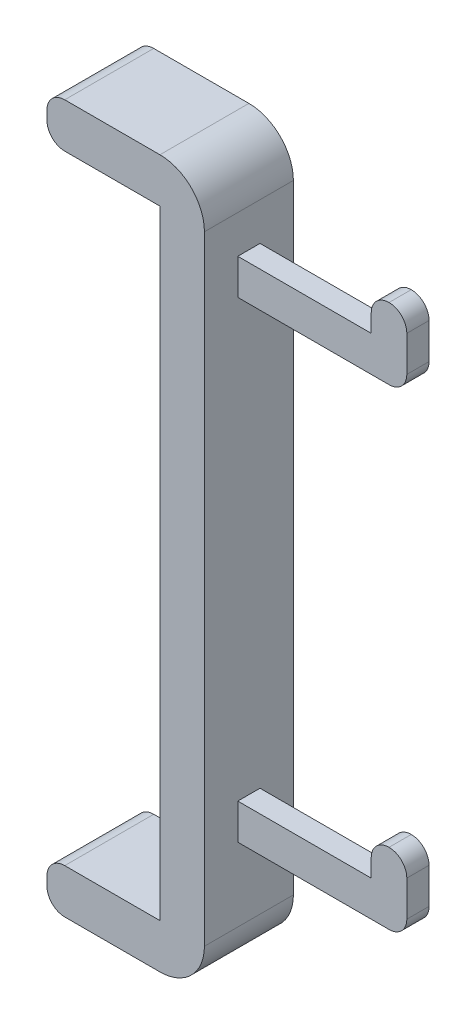
ISO-10303-21;
HEADER;
FILE_DESCRIPTION(('STEP AP214'),'2;1');
FILE_NAME('part.step','',(''),(''),'','','');
FILE_SCHEMA(('AUTOMOTIVE_DESIGN { 1 0 10303 214 1 1 1 1 }'));
ENDSEC;
DATA;
#1=APPLICATION_CONTEXT('core data for automotive mechanical design processes');
#2=APPLICATION_PROTOCOL_DEFINITION('international standard','automotive_design',2000,#1);
#3=PRODUCT_CONTEXT('',#1,'mechanical');
#4=PRODUCT('Part','Part','',(#3));
#5=PRODUCT_RELATED_PRODUCT_CATEGORY('part','',(#4));
#6=PRODUCT_DEFINITION_FORMATION('','',#4);
#7=PRODUCT_DEFINITION_CONTEXT('part definition',#1,'design');
#8=PRODUCT_DEFINITION('design','',#6,#7);
#9=PRODUCT_DEFINITION_SHAPE('','',#8);
#10=(LENGTH_UNIT() NAMED_UNIT(*) SI_UNIT(.MILLI.,.METRE.));
#11=(NAMED_UNIT(*) PLANE_ANGLE_UNIT() SI_UNIT($,.RADIAN.));
#12=(NAMED_UNIT(*) SI_UNIT($,.STERADIAN.) SOLID_ANGLE_UNIT());
#13=UNCERTAINTY_MEASURE_WITH_UNIT(LENGTH_MEASURE(1.E-05),#10,'distance_accuracy_value','');
#14=(GEOMETRIC_REPRESENTATION_CONTEXT(3) GLOBAL_UNCERTAINTY_ASSIGNED_CONTEXT((#13)) GLOBAL_UNIT_ASSIGNED_CONTEXT((#10,
#11,#12)) REPRESENTATION_CONTEXT('',''));
#15=CARTESIAN_POINT('',(0.,0.,0.));
#16=DIRECTION('',(0.,0.,1.));
#17=DIRECTION('',(1.,0.,0.));
#18=AXIS2_PLACEMENT_3D('',#15,#16,#17);
#19=CARTESIAN_POINT('',(-22.5103825249103,0.,-10.));
#20=DIRECTION('',(1.,0.,0.));
#21=DIRECTION('',(0.,0.,-1.));
#22=AXIS2_PLACEMENT_3D('',#19,#20,#21);
#23=PLANE('',#22);
#24=DIRECTION('',(0.,1.,0.));
#25=VECTOR('',#24,1.);
#26=CARTESIAN_POINT('',(-22.5103825249103,0.,-10.));
#27=LINE('',#26,#25);
#28=CARTESIAN_POINT('',(-22.5103825249103,-92.3717774812002,-10.));
#29=VERTEX_POINT('',#28);
#30=CARTESIAN_POINT('',(-22.5103825249103,46.7282225187998,-10.));
#31=VERTEX_POINT('',#30);
#32=EDGE_CURVE('E339',#29,#31,#27,.T.);
#33=ORIENTED_EDGE('',*,*,#32,.T.);
#34=DIRECTION('',(0.,0.,1.));
#35=VECTOR('',#34,1.);
#36=CARTESIAN_POINT('',(-22.5103825249103,46.7282225187998,10.));
#37=LINE('',#36,#35);
#38=CARTESIAN_POINT('',(-22.5103825249103,46.7282225187998,10.));
#39=VERTEX_POINT('',#38);
#40=EDGE_CURVE('E365',#31,#39,#37,.T.);
#41=ORIENTED_EDGE('',*,*,#40,.T.);
#42=DIRECTION('',(0.,1.,0.));
#43=VECTOR('',#42,1.);
#44=CARTESIAN_POINT('',(-22.5103825249103,0.,10.));
#45=LINE('',#44,#43);
#46=CARTESIAN_POINT('',(-22.5103825249103,-92.3717774812002,10.));
#47=VERTEX_POINT('',#46);
#48=EDGE_CURVE('E314',#47,#39,#45,.T.);
#49=ORIENTED_EDGE('',*,*,#48,.F.);
#50=DIRECTION('',(0.,0.,1.));
#51=VECTOR('',#50,1.);
#52=CARTESIAN_POINT('',(-22.5103825249103,-92.3717774812002,-10.));
#53=LINE('',#52,#51);
#54=EDGE_CURVE('E362',#47,#29,#53,.F.);
#55=ORIENTED_EDGE('',*,*,#54,.T.);
#56=EDGE_LOOP('',(#33,#41,#49,#55));
#57=FACE_BOUND('',#56,.T.);
#58=DIRECTION('',(0.,0.,1.));
#59=VECTOR('',#58,1.);
#60=CARTESIAN_POINT('',(-22.5103825249103,38.2115558521331,-2.5));
#61=LINE('',#60,#59);
#62=CARTESIAN_POINT('',(-22.5103825249103,38.2115558521331,-2.5));
#63=VERTEX_POINT('',#62);
#64=CARTESIAN_POINT('',(-22.5103825249103,38.2115558521331,2.5));
#65=VERTEX_POINT('',#64);
#66=EDGE_CURVE('E315',#63,#65,#61,.T.);
#67=ORIENTED_EDGE('',*,*,#66,.F.);
#68=DIRECTION('',(0.,1.,0.));
#69=VECTOR('',#68,1.);
#70=CARTESIAN_POINT('',(-22.5103825249103,0.,-2.5));
#71=LINE('',#70,#69);
#72=CARTESIAN_POINT('',(-22.5103825249103,30.2115558521331,-2.5));
#73=VERTEX_POINT('',#72);
#74=EDGE_CURVE('E302',#73,#63,#71,.T.);
#75=ORIENTED_EDGE('',*,*,#74,.F.);
#76=DIRECTION('',(0.,0.,1.));
#77=VECTOR('',#76,1.);
#78=CARTESIAN_POINT('',(-22.5103825249103,30.2115558521331,-2.5));
#79=LINE('',#78,#77);
#80=CARTESIAN_POINT('',(-22.5103825249103,30.2115558521331,2.5));
#81=VERTEX_POINT('',#80);
#82=EDGE_CURVE('E312',#73,#81,#79,.T.);
#83=ORIENTED_EDGE('',*,*,#82,.T.);
#84=DIRECTION('',(0.,1.,0.));
#85=VECTOR('',#84,1.);
#86=CARTESIAN_POINT('',(-22.5103825249103,0.,2.5));
#87=LINE('',#86,#85);
#88=EDGE_CURVE('E289',#81,#65,#87,.T.);
#89=ORIENTED_EDGE('',*,*,#88,.T.);
#90=EDGE_LOOP('',(#67,#75,#83,#89));
#91=FACE_BOUND('',#90,.T.);
#92=DIRECTION('',(0.,0.,1.));
#93=VECTOR('',#92,1.);
#94=CARTESIAN_POINT('',(-22.5103825249103,-67.8551108145335,-2.5));
#95=LINE('',#94,#93);
#96=CARTESIAN_POINT('',(-22.5103825249103,-67.8551108145335,-2.5));
#97=VERTEX_POINT('',#96);
#98=CARTESIAN_POINT('',(-22.5103825249103,-67.8551108145335,2.5));
#99=VERTEX_POINT('',#98);
#100=EDGE_CURVE('E255',#97,#99,#95,.T.);
#101=ORIENTED_EDGE('',*,*,#100,.F.);
#102=DIRECTION('',(0.,1.,0.));
#103=VECTOR('',#102,1.);
#104=CARTESIAN_POINT('',(-22.5103825249103,0.,-2.5));
#105=LINE('',#104,#103);
#106=CARTESIAN_POINT('',(-22.5103825249103,-75.8551108145336,-2.5));
#107=VERTEX_POINT('',#106);
#108=EDGE_CURVE('E273',#107,#97,#105,.T.);
#109=ORIENTED_EDGE('',*,*,#108,.F.);
#110=DIRECTION('',(0.,0.,1.));
#111=VECTOR('',#110,1.);
#112=CARTESIAN_POINT('',(-22.5103825249103,-75.8551108145336,-2.5));
#113=LINE('',#112,#111);
#114=CARTESIAN_POINT('',(-22.5103825249103,-75.8551108145336,2.5));
#115=VERTEX_POINT('',#114);
#116=EDGE_CURVE('E281',#107,#115,#113,.T.);
#117=ORIENTED_EDGE('',*,*,#116,.T.);
#118=DIRECTION('',(0.,1.,0.));
#119=VECTOR('',#118,1.);
#120=CARTESIAN_POINT('',(-22.5103825249103,0.,2.5));
#121=LINE('',#120,#119);
#122=EDGE_CURVE('E260',#115,#99,#121,.T.);
#123=ORIENTED_EDGE('',*,*,#122,.T.);
#124=EDGE_LOOP('',(#101,#109,#117,#123));
#125=FACE_BOUND('',#124,.T.);
#126=ADVANCED_FACE('F37',(#57,#91,#125),#23,.T.);
#127=CARTESIAN_POINT('',(0.,-102.3717774812,-10.));
#128=DIRECTION('',(0.,1.,0.));
#129=DIRECTION('',(-1.,0.,0.));
#130=AXIS2_PLACEMENT_3D('',#127,#128,#129);
#131=PLANE('',#130);
#132=DIRECTION('',(-1.,0.,0.));
#133=VECTOR('',#132,1.);
#134=CARTESIAN_POINT('',(0.,-102.3717774812,10.));
#135=LINE('',#134,#133);
#136=CARTESIAN_POINT('',(-32.5103825249103,-102.3717774812,10.));
#137=VERTEX_POINT('',#136);
#138=CARTESIAN_POINT('',(-53.9103825249103,-102.3717774812,10.));
#139=VERTEX_POINT('',#138);
#140=EDGE_CURVE('E336',#137,#139,#135,.T.);
#141=ORIENTED_EDGE('',*,*,#140,.T.);
#142=DIRECTION('',(0.,0.,1.));
#143=VECTOR('',#142,1.);
#144=CARTESIAN_POINT('',(-53.9103825249103,-102.3717774812,-10.));
#145=LINE('',#144,#143);
#146=CARTESIAN_POINT('',(-53.9103825249103,-102.3717774812,-10.));
#147=VERTEX_POINT('',#146);
#148=EDGE_CURVE('E395',#139,#147,#145,.F.);
#149=ORIENTED_EDGE('',*,*,#148,.T.);
#150=DIRECTION('',(-1.,0.,0.));
#151=VECTOR('',#150,1.);
#152=CARTESIAN_POINT('',(0.,-102.3717774812,-10.));
#153=LINE('',#152,#151);
#154=CARTESIAN_POINT('',(-32.5103825249103,-102.3717774812,-10.));
#155=VERTEX_POINT('',#154);
#156=EDGE_CURVE('E355',#155,#147,#153,.T.);
#157=ORIENTED_EDGE('',*,*,#156,.F.);
#158=DIRECTION('',(0.,0.,1.));
#159=VECTOR('',#158,1.);
#160=CARTESIAN_POINT('',(-32.5103825249103,-102.3717774812,10.));
#161=LINE('',#160,#159);
#162=EDGE_CURVE('E380',#155,#137,#161,.T.);
#163=ORIENTED_EDGE('',*,*,#162,.T.);
#164=EDGE_LOOP('',(#141,#149,#157,#163));
#165=FACE_BOUND('',#164,.T.);
#166=ADVANCED_FACE('F497',(#165),#131,.F.);
#167=CARTESIAN_POINT('',(-57.9103825249103,0.,-10.));
#168=DIRECTION('',(1.,0.,0.));
#169=DIRECTION('',(0.,0.,-1.));
#170=AXIS2_PLACEMENT_3D('',#167,#168,#169);
#171=PLANE('',#170);
#172=DIRECTION('',(0.,1.,0.));
#173=VECTOR('',#172,1.);
#174=CARTESIAN_POINT('',(-57.9103825249103,0.,-10.));
#175=LINE('',#174,#173);
#176=CARTESIAN_POINT('',(-57.9103825249103,-98.3717774812002,-10.));
#177=VERTEX_POINT('',#176);
#178=CARTESIAN_POINT('',(-57.9103825249103,-96.3717774812002,-10.));
#179=VERTEX_POINT('',#178);
#180=EDGE_CURVE('E352',#177,#179,#175,.T.);
#181=ORIENTED_EDGE('',*,*,#180,.F.);
#182=DIRECTION('',(0.,0.,1.));
#183=VECTOR('',#182,1.);
#184=CARTESIAN_POINT('',(-57.9103825249103,-98.3717774812002,-10.));
#185=LINE('',#184,#183);
#186=CARTESIAN_POINT('',(-57.9103825249103,-98.3717774812002,10.));
#187=VERTEX_POINT('',#186);
#188=EDGE_CURVE('E385',#177,#187,#185,.T.);
#189=ORIENTED_EDGE('',*,*,#188,.T.);
#190=DIRECTION('',(0.,1.,0.));
#191=VECTOR('',#190,1.);
#192=CARTESIAN_POINT('',(-57.9103825249103,0.,10.));
#193=LINE('',#192,#191);
#194=CARTESIAN_POINT('',(-57.9103825249103,-96.3717774812002,10.));
#195=VERTEX_POINT('',#194);
#196=EDGE_CURVE('E333',#187,#195,#193,.T.);
#197=ORIENTED_EDGE('',*,*,#196,.T.);
#198=DIRECTION('',(0.,0.,1.));
#199=VECTOR('',#198,1.);
#200=CARTESIAN_POINT('',(-57.9103825249103,-96.3717774812002,-10.));
#201=LINE('',#200,#199);
#202=EDGE_CURVE('E383',#195,#179,#201,.F.);
#203=ORIENTED_EDGE('',*,*,#202,.T.);
#204=EDGE_LOOP('',(#181,#189,#197,#203));
#205=FACE_BOUND('',#204,.T.);
#206=ADVANCED_FACE('F506',(#205),#171,.F.);
#207=CARTESIAN_POINT('',(0.,-92.3717774812003,-10.));
#208=DIRECTION('',(0.,-1.,0.));
#209=DIRECTION('',(1.,0.,0.));
#210=AXIS2_PLACEMENT_3D('',#207,#208,#209);
#211=PLANE('',#210);
#212=DIRECTION('',(1.,0.,0.));
#213=VECTOR('',#212,1.);
#214=CARTESIAN_POINT('',(0.,-92.3717774812003,-10.));
#215=LINE('',#214,#213);
#216=CARTESIAN_POINT('',(-53.9103825249103,-92.3717774812002,-10.));
#217=VERTEX_POINT('',#216);
#218=CARTESIAN_POINT('',(-32.5103825249103,-92.3717774812003,-10.));
#219=VERTEX_POINT('',#218);
#220=EDGE_CURVE('E350',#217,#219,#215,.T.);
#221=ORIENTED_EDGE('',*,*,#220,.F.);
#222=DIRECTION('',(0.,0.,1.));
#223=VECTOR('',#222,1.);
#224=CARTESIAN_POINT('',(-53.9103825249103,-92.3717774812002,-10.));
#225=LINE('',#224,#223);
#226=CARTESIAN_POINT('',(-53.9103825249103,-92.3717774812002,10.));
#227=VERTEX_POINT('',#226);
#228=EDGE_CURVE('E403',#217,#227,#225,.T.);
#229=ORIENTED_EDGE('',*,*,#228,.T.);
#230=DIRECTION('',(1.,0.,0.));
#231=VECTOR('',#230,1.);
#232=CARTESIAN_POINT('',(0.,-92.3717774812003,10.));
#233=LINE('',#232,#231);
#234=CARTESIAN_POINT('',(-32.5103825249103,-92.3717774812003,10.));
#235=VERTEX_POINT('',#234);
#236=EDGE_CURVE('E331',#227,#235,#233,.T.);
#237=ORIENTED_EDGE('',*,*,#236,.T.);
#238=DIRECTION('',(0.,0.,1.));
#239=VECTOR('',#238,1.);
#240=CARTESIAN_POINT('',(-32.5103825249103,-92.3717774812003,-10.));
#241=LINE('',#240,#239);
#242=EDGE_CURVE('E359',#219,#235,#241,.T.);
#243=ORIENTED_EDGE('',*,*,#242,.F.);
#244=EDGE_LOOP('',(#221,#229,#237,#243));
#245=FACE_BOUND('',#244,.T.);
#246=ADVANCED_FACE('F515',(#245),#211,.F.);
#247=CARTESIAN_POINT('',(-32.5103825249103,0.,-10.));
#248=DIRECTION('',(1.,0.,0.));
#249=DIRECTION('',(0.,1.,0.));
#250=AXIS2_PLACEMENT_3D('',#247,#248,#249);
#251=PLANE('',#250);
#252=ORIENTED_EDGE('',*,*,#242,.T.);
#253=DIRECTION('',(0.,1.,0.));
#254=VECTOR('',#253,1.);
#255=CARTESIAN_POINT('',(-32.5103825249103,0.,10.));
#256=LINE('',#255,#254);
#257=CARTESIAN_POINT('',(-32.5103825249103,46.7282225187998,10.));
#258=VERTEX_POINT('',#257);
#259=EDGE_CURVE('E328',#235,#258,#256,.T.);
#260=ORIENTED_EDGE('',*,*,#259,.T.);
#261=DIRECTION('',(0.,0.,1.));
#262=VECTOR('',#261,1.);
#263=CARTESIAN_POINT('',(-32.5103825249103,46.7282225187998,-10.));
#264=LINE('',#263,#262);
#265=CARTESIAN_POINT('',(-32.5103825249103,46.7282225187998,-10.));
#266=VERTEX_POINT('',#265);
#267=EDGE_CURVE('E358',#266,#258,#264,.T.);
#268=ORIENTED_EDGE('',*,*,#267,.F.);
#269=DIRECTION('',(0.,1.,0.));
#270=VECTOR('',#269,1.);
#271=CARTESIAN_POINT('',(-32.5103825249103,0.,-10.));
#272=LINE('',#271,#270);
#273=EDGE_CURVE('E348',#219,#266,#272,.T.);
#274=ORIENTED_EDGE('',*,*,#273,.F.);
#275=EDGE_LOOP('',(#252,#260,#268,#274));
#276=FACE_BOUND('',#275,.T.);
#277=ADVANCED_FACE('F521',(#276),#251,.F.);
#278=CARTESIAN_POINT('',(0.,46.7282225187998,-10.));
#279=DIRECTION('',(0.,1.,0.));
#280=DIRECTION('',(0.,0.,1.));
#281=AXIS2_PLACEMENT_3D('',#278,#279,#280);
#282=PLANE('',#281);
#283=DIRECTION('',(-1.,0.,0.));
#284=VECTOR('',#283,1.);
#285=CARTESIAN_POINT('',(0.,46.7282225187998,10.));
#286=LINE('',#285,#284);
#287=CARTESIAN_POINT('',(-53.9103825249103,46.7282225187998,10.));
#288=VERTEX_POINT('',#287);
#289=EDGE_CURVE('E326',#258,#288,#286,.T.);
#290=ORIENTED_EDGE('',*,*,#289,.T.);
#291=DIRECTION('',(0.,0.,1.));
#292=VECTOR('',#291,1.);
#293=CARTESIAN_POINT('',(-53.9103825249103,46.7282225187998,-10.));
#294=LINE('',#293,#292);
#295=CARTESIAN_POINT('',(-53.9103825249103,46.7282225187998,-10.));
#296=VERTEX_POINT('',#295);
#297=EDGE_CURVE('E45',#288,#296,#294,.F.);
#298=ORIENTED_EDGE('',*,*,#297,.T.);
#299=DIRECTION('',(-1.,0.,0.));
#300=VECTOR('',#299,1.);
#301=CARTESIAN_POINT('',(0.,46.7282225187998,-10.));
#302=LINE('',#301,#300);
#303=EDGE_CURVE('E346',#266,#296,#302,.T.);
#304=ORIENTED_EDGE('',*,*,#303,.F.);
#305=ORIENTED_EDGE('',*,*,#267,.T.);
#306=EDGE_LOOP('',(#290,#298,#304,#305));
#307=FACE_BOUND('',#306,.T.);
#308=ADVANCED_FACE('F624',(#307),#282,.F.);
#309=CARTESIAN_POINT('',(-57.9103825249103,0.,-10.));
#310=DIRECTION('',(1.,0.,0.));
#311=DIRECTION('',(0.,0.,-1.));
#312=AXIS2_PLACEMENT_3D('',#309,#310,#311);
#313=PLANE('',#312);
#314=DIRECTION('',(0.,1.,0.));
#315=VECTOR('',#314,1.);
#316=CARTESIAN_POINT('',(-57.9103825249103,0.,-10.));
#317=LINE('',#316,#315);
#318=CARTESIAN_POINT('',(-57.9103825249103,50.7282225187998,-10.));
#319=VERTEX_POINT('',#318);
#320=CARTESIAN_POINT('',(-57.9103825249103,52.7282225187998,-10.));
#321=VERTEX_POINT('',#320);
#322=EDGE_CURVE('E344',#319,#321,#317,.T.);
#323=ORIENTED_EDGE('',*,*,#322,.F.);
#324=DIRECTION('',(0.,0.,1.));
#325=VECTOR('',#324,1.);
#326=CARTESIAN_POINT('',(-57.9103825249103,50.7282225187998,-10.));
#327=LINE('',#326,#325);
#328=CARTESIAN_POINT('',(-57.9103825249103,50.7282225187998,10.));
#329=VERTEX_POINT('',#328);
#330=EDGE_CURVE('E454',#319,#329,#327,.T.);
#331=ORIENTED_EDGE('',*,*,#330,.T.);
#332=DIRECTION('',(0.,1.,0.));
#333=VECTOR('',#332,1.);
#334=CARTESIAN_POINT('',(-57.9103825249103,0.,10.));
#335=LINE('',#334,#333);
#336=CARTESIAN_POINT('',(-57.9103825249103,52.7282225187998,10.));
#337=VERTEX_POINT('',#336);
#338=EDGE_CURVE('E324',#329,#337,#335,.T.);
#339=ORIENTED_EDGE('',*,*,#338,.T.);
#340=DIRECTION('',(0.,0.,1.));
#341=VECTOR('',#340,1.);
#342=CARTESIAN_POINT('',(-57.9103825249103,52.7282225187998,-10.));
#343=LINE('',#342,#341);
#344=EDGE_CURVE('E451',#337,#321,#343,.F.);
#345=ORIENTED_EDGE('',*,*,#344,.T.);
#346=EDGE_LOOP('',(#323,#331,#339,#345));
#347=FACE_BOUND('',#346,.T.);
#348=ADVANCED_FACE('F465',(#347),#313,.F.);
#349=CARTESIAN_POINT('',(0.,56.7282225187998,-10.));
#350=DIRECTION('',(0.,-1.,0.));
#351=DIRECTION('',(1.,0.,0.));
#352=AXIS2_PLACEMENT_3D('',#349,#350,#351);
#353=PLANE('',#352);
#354=DIRECTION('',(1.,0.,0.));
#355=VECTOR('',#354,1.);
#356=CARTESIAN_POINT('',(0.,56.7282225187998,-10.));
#357=LINE('',#356,#355);
#358=CARTESIAN_POINT('',(-53.9103825249103,56.7282225187998,-10.));
#359=VERTEX_POINT('',#358);
#360=CARTESIAN_POINT('',(-32.5103825249103,56.7282225187998,-10.));
#361=VERTEX_POINT('',#360);
#362=EDGE_CURVE('E342',#359,#361,#357,.T.);
#363=ORIENTED_EDGE('',*,*,#362,.F.);
#364=DIRECTION('',(0.,0.,1.));
#365=VECTOR('',#364,1.);
#366=CARTESIAN_POINT('',(-53.9103825249103,56.7282225187998,-10.));
#367=LINE('',#366,#365);
#368=CARTESIAN_POINT('',(-53.9103825249103,56.7282225187998,10.));
#369=VERTEX_POINT('',#368);
#370=EDGE_CURVE('E448',#359,#369,#367,.T.);
#371=ORIENTED_EDGE('',*,*,#370,.T.);
#372=DIRECTION('',(1.,0.,0.));
#373=VECTOR('',#372,1.);
#374=CARTESIAN_POINT('',(0.,56.7282225187998,10.));
#375=LINE('',#374,#373);
#376=CARTESIAN_POINT('',(-32.5103825249103,56.7282225187998,10.));
#377=VERTEX_POINT('',#376);
#378=EDGE_CURVE('E322',#369,#377,#375,.T.);
#379=ORIENTED_EDGE('',*,*,#378,.T.);
#380=DIRECTION('',(0.,0.,1.));
#381=VECTOR('',#380,1.);
#382=CARTESIAN_POINT('',(-32.5103825249103,56.7282225187998,-10.));
#383=LINE('',#382,#381);
#384=EDGE_CURVE('E373',#377,#361,#383,.F.);
#385=ORIENTED_EDGE('',*,*,#384,.T.);
#386=EDGE_LOOP('',(#363,#371,#379,#385));
#387=FACE_BOUND('',#386,.T.);
#388=ADVANCED_FACE('F479',(#387),#353,.F.);
#389=CARTESIAN_POINT('',(0.,0.,-10.));
#390=DIRECTION('',(0.,0.,1.));
#391=DIRECTION('',(1.,0.,0.));
#392=AXIS2_PLACEMENT_3D('',#389,#390,#391);
#393=PLANE('',#392);
#394=ORIENTED_EDGE('',*,*,#303,.T.);
#395=CARTESIAN_POINT('',(-53.9103825249103,50.7282225187998,-10.));
#396=DIRECTION('',(0.,0.,1.));
#397=DIRECTION('',(1.,0.,0.));
#398=AXIS2_PLACEMENT_3D('',#395,#396,#397);
#399=CIRCLE('',#398,4.);
#400=EDGE_CURVE('E11',#296,#319,#399,.F.);
#401=ORIENTED_EDGE('',*,*,#400,.T.);
#402=ORIENTED_EDGE('',*,*,#322,.T.);
#403=CARTESIAN_POINT('',(-53.9103825249103,52.7282225187998,-10.));
#404=DIRECTION('',(0.,0.,1.));
#405=DIRECTION('',(1.,0.,0.));
#406=AXIS2_PLACEMENT_3D('',#403,#404,#405);
#407=CIRCLE('',#406,4.);
#408=EDGE_CURVE('E397',#321,#359,#407,.F.);
#409=ORIENTED_EDGE('',*,*,#408,.T.);
#410=ORIENTED_EDGE('',*,*,#362,.T.);
#411=CARTESIAN_POINT('',(-32.5103825249103,46.7282225187998,-10.));
#412=DIRECTION('',(0.,0.,1.));
#413=DIRECTION('',(1.,0.,0.));
#414=AXIS2_PLACEMENT_3D('',#411,#412,#413);
#415=CIRCLE('',#414,10.);
#416=EDGE_CURVE('E378',#361,#31,#415,.F.);
#417=ORIENTED_EDGE('',*,*,#416,.T.);
#418=ORIENTED_EDGE('',*,*,#32,.F.);
#419=CARTESIAN_POINT('',(-32.5103825249103,-92.3717774812002,-10.));
#420=DIRECTION('',(0.,0.,1.));
#421=DIRECTION('',(1.,0.,0.));
#422=AXIS2_PLACEMENT_3D('',#419,#420,#421);
#423=CIRCLE('',#422,10.);
#424=EDGE_CURVE('E376',#29,#155,#423,.F.);
#425=ORIENTED_EDGE('',*,*,#424,.T.);
#426=ORIENTED_EDGE('',*,*,#156,.T.);
#427=CARTESIAN_POINT('',(-53.9103825249103,-98.3717774812002,-10.));
#428=DIRECTION('',(0.,0.,1.));
#429=DIRECTION('',(1.,0.,0.));
#430=AXIS2_PLACEMENT_3D('',#427,#428,#429);
#431=CIRCLE('',#430,4.);
#432=EDGE_CURVE('E401',#147,#177,#431,.F.);
#433=ORIENTED_EDGE('',*,*,#432,.T.);
#434=ORIENTED_EDGE('',*,*,#180,.T.);
#435=CARTESIAN_POINT('',(-53.9103825249103,-96.3717774812002,-10.));
#436=DIRECTION('',(0.,0.,1.));
#437=DIRECTION('',(1.,0.,0.));
#438=AXIS2_PLACEMENT_3D('',#435,#436,#437);
#439=CIRCLE('',#438,4.);
#440=EDGE_CURVE('E399',#179,#217,#439,.F.);
#441=ORIENTED_EDGE('',*,*,#440,.T.);
#442=ORIENTED_EDGE('',*,*,#220,.T.);
#443=ORIENTED_EDGE('',*,*,#273,.T.);
#444=EDGE_LOOP('',(#394,#401,#402,#409,#410,#417,#418,#425,#426,#433,#434,#441,#442,#443));
#445=FACE_BOUND('',#444,.T.);
#446=ADVANCED_FACE('F477',(#445),#393,.F.);
#447=CARTESIAN_POINT('',(0.,0.,10.));
#448=DIRECTION('',(0.,0.,1.));
#449=DIRECTION('',(1.,0.,0.));
#450=AXIS2_PLACEMENT_3D('',#447,#448,#449);
#451=PLANE('',#450);
#452=ORIENTED_EDGE('',*,*,#338,.F.);
#453=CARTESIAN_POINT('',(-53.9103825249103,50.7282225187998,10.));
#454=DIRECTION('',(0.,0.,1.));
#455=DIRECTION('',(1.,0.,0.));
#456=AXIS2_PLACEMENT_3D('',#453,#454,#455);
#457=CIRCLE('',#456,4.);
#458=EDGE_CURVE('E59',#329,#288,#457,.T.);
#459=ORIENTED_EDGE('',*,*,#458,.T.);
#460=ORIENTED_EDGE('',*,*,#289,.F.);
#461=ORIENTED_EDGE('',*,*,#259,.F.);
#462=ORIENTED_EDGE('',*,*,#236,.F.);
#463=CARTESIAN_POINT('',(-53.9103825249103,-96.3717774812002,10.));
#464=DIRECTION('',(0.,0.,1.));
#465=DIRECTION('',(1.,0.,0.));
#466=AXIS2_PLACEMENT_3D('',#463,#464,#465);
#467=CIRCLE('',#466,4.);
#468=EDGE_CURVE('E391',#227,#195,#467,.T.);
#469=ORIENTED_EDGE('',*,*,#468,.T.);
#470=ORIENTED_EDGE('',*,*,#196,.F.);
#471=CARTESIAN_POINT('',(-53.9103825249103,-98.3717774812002,10.));
#472=DIRECTION('',(0.,0.,1.));
#473=DIRECTION('',(1.,0.,0.));
#474=AXIS2_PLACEMENT_3D('',#471,#472,#473);
#475=CIRCLE('',#474,4.);
#476=EDGE_CURVE('E393',#187,#139,#475,.T.);
#477=ORIENTED_EDGE('',*,*,#476,.T.);
#478=ORIENTED_EDGE('',*,*,#140,.F.);
#479=CARTESIAN_POINT('',(-32.5103825249103,-92.3717774812002,10.));
#480=DIRECTION('',(0.,0.,1.));
#481=DIRECTION('',(1.,0.,0.));
#482=AXIS2_PLACEMENT_3D('',#479,#480,#481);
#483=CIRCLE('',#482,10.);
#484=EDGE_CURVE('E368',#137,#47,#483,.T.);
#485=ORIENTED_EDGE('',*,*,#484,.T.);
#486=ORIENTED_EDGE('',*,*,#48,.T.);
#487=CARTESIAN_POINT('',(-32.5103825249103,46.7282225187998,10.));
#488=DIRECTION('',(0.,0.,1.));
#489=DIRECTION('',(1.,0.,0.));
#490=AXIS2_PLACEMENT_3D('',#487,#488,#489);
#491=CIRCLE('',#490,10.);
#492=EDGE_CURVE('E370',#39,#377,#491,.T.);
#493=ORIENTED_EDGE('',*,*,#492,.T.);
#494=ORIENTED_EDGE('',*,*,#378,.F.);
#495=CARTESIAN_POINT('',(-53.9103825249103,52.7282225187998,10.));
#496=DIRECTION('',(0.,0.,1.));
#497=DIRECTION('',(1.,0.,0.));
#498=AXIS2_PLACEMENT_3D('',#495,#496,#497);
#499=CIRCLE('',#498,4.);
#500=EDGE_CURVE('E388',#369,#337,#499,.T.);
#501=ORIENTED_EDGE('',*,*,#500,.T.);
#502=EDGE_LOOP('',(#452,#459,#460,#461,#462,#469,#470,#477,#478,#485,#486,#493,#494,#501));
#503=FACE_BOUND('',#502,.T.);
#504=ADVANCED_FACE('F468',(#503),#451,.T.);
#505=CARTESIAN_POINT('',(7.48961747508973,0.,-2.5));
#506=DIRECTION('',(-1.,0.,0.));
#507=DIRECTION('',(0.,-1.,0.));
#508=AXIS2_PLACEMENT_3D('',#505,#506,#507);
#509=PLANE('',#508);
#510=DIRECTION('',(0.,-1.,0.));
#511=VECTOR('',#510,1.);
#512=CARTESIAN_POINT('',(7.48961747508973,0.,2.5));
#513=LINE('',#512,#511);
#514=CARTESIAN_POINT('',(7.48961747508972,42.2115558521331,2.5));
#515=VERTEX_POINT('',#514);
#516=CARTESIAN_POINT('',(7.48961747508972,38.2115558521331,2.5));
#517=VERTEX_POINT('',#516);
#518=EDGE_CURVE('E283',#515,#517,#513,.T.);
#519=ORIENTED_EDGE('',*,*,#518,.F.);
#520=DIRECTION('',(0.,0.,1.));
#521=VECTOR('',#520,1.);
#522=CARTESIAN_POINT('',(7.48961747508972,42.2115558521331,-2.5));
#523=LINE('',#522,#521);
#524=CARTESIAN_POINT('',(7.48961747508972,42.2115558521331,-2.5));
#525=VERTEX_POINT('',#524);
#526=EDGE_CURVE('E432',#515,#525,#523,.F.);
#527=ORIENTED_EDGE('',*,*,#526,.T.);
#528=DIRECTION('',(0.,-1.,0.));
#529=VECTOR('',#528,1.);
#530=CARTESIAN_POINT('',(7.48961747508973,0.,-2.5));
#531=LINE('',#530,#529);
#532=CARTESIAN_POINT('',(7.48961747508972,38.2115558521331,-2.5));
#533=VERTEX_POINT('',#532);
#534=EDGE_CURVE('E297',#525,#533,#531,.T.);
#535=ORIENTED_EDGE('',*,*,#534,.T.);
#536=DIRECTION('',(0.,0.,1.));
#537=VECTOR('',#536,1.);
#538=CARTESIAN_POINT('',(7.48961747508972,38.2115558521331,-2.5));
#539=LINE('',#538,#537);
#540=EDGE_CURVE('E311',#533,#517,#539,.T.);
#541=ORIENTED_EDGE('',*,*,#540,.T.);
#542=EDGE_LOOP('',(#519,#527,#535,#541));
#543=FACE_BOUND('',#542,.T.);
#544=ADVANCED_FACE('F589',(#543),#509,.T.);
#545=CARTESIAN_POINT('',(15.4896174750897,0.,-2.5));
#546=DIRECTION('',(1.,0.,0.));
#547=DIRECTION('',(0.,1.,0.));
#548=AXIS2_PLACEMENT_3D('',#545,#546,#547);
#549=PLANE('',#548);
#550=DIRECTION('',(0.,1.,0.));
#551=VECTOR('',#550,1.);
#552=CARTESIAN_POINT('',(15.4896174750897,0.,-2.5));
#553=LINE('',#552,#551);
#554=CARTESIAN_POINT('',(15.4896174750897,34.2115558521331,-2.5));
#555=VERTEX_POINT('',#554);
#556=CARTESIAN_POINT('',(15.4896174750897,42.2115558521331,-2.5));
#557=VERTEX_POINT('',#556);
#558=EDGE_CURVE('E308',#555,#557,#553,.T.);
#559=ORIENTED_EDGE('',*,*,#558,.T.);
#560=DIRECTION('',(0.,0.,1.));
#561=VECTOR('',#560,1.);
#562=CARTESIAN_POINT('',(15.4896174750897,42.2115558521331,-2.5));
#563=LINE('',#562,#561);
#564=CARTESIAN_POINT('',(15.4896174750897,42.2115558521331,2.5));
#565=VERTEX_POINT('',#564);
#566=EDGE_CURVE('E443',#557,#565,#563,.T.);
#567=ORIENTED_EDGE('',*,*,#566,.T.);
#568=DIRECTION('',(0.,1.,0.));
#569=VECTOR('',#568,1.);
#570=CARTESIAN_POINT('',(15.4896174750897,0.,2.5));
#571=LINE('',#570,#569);
#572=CARTESIAN_POINT('',(15.4896174750897,34.2115558521331,2.5));
#573=VERTEX_POINT('',#572);
#574=EDGE_CURVE('E294',#573,#565,#571,.T.);
#575=ORIENTED_EDGE('',*,*,#574,.F.);
#576=DIRECTION('',(0.,0.,1.));
#577=VECTOR('',#576,1.);
#578=CARTESIAN_POINT('',(15.4896174750897,34.2115558521331,-2.5));
#579=LINE('',#578,#577);
#580=EDGE_CURVE('E441',#573,#555,#579,.F.);
#581=ORIENTED_EDGE('',*,*,#580,.T.);
#582=EDGE_LOOP('',(#559,#567,#575,#581));
#583=FACE_BOUND('',#582,.T.);
#584=ADVANCED_FACE('F600',(#583),#549,.T.);
#585=CARTESIAN_POINT('',(0.,30.2115558521331,-2.5));
#586=DIRECTION('',(0.,-1.,0.));
#587=DIRECTION('',(0.,0.,-1.));
#588=AXIS2_PLACEMENT_3D('',#585,#586,#587);
#589=PLANE('',#588);
#590=DIRECTION('',(1.,0.,0.));
#591=VECTOR('',#590,1.);
#592=CARTESIAN_POINT('',(0.,30.2115558521331,-2.5));
#593=LINE('',#592,#591);
#594=CARTESIAN_POINT('',(11.4896174750897,30.2115558521331,-2.5));
#595=VERTEX_POINT('',#594);
#596=EDGE_CURVE('E305',#73,#595,#593,.T.);
#597=ORIENTED_EDGE('',*,*,#596,.T.);
#598=DIRECTION('',(0.,0.,1.));
#599=VECTOR('',#598,1.);
#600=CARTESIAN_POINT('',(11.4896174750897,30.2115558521331,-2.5));
#601=LINE('',#600,#599);
#602=CARTESIAN_POINT('',(11.4896174750897,30.2115558521331,2.5));
#603=VERTEX_POINT('',#602);
#604=EDGE_CURVE('E445',#595,#603,#601,.T.);
#605=ORIENTED_EDGE('',*,*,#604,.T.);
#606=DIRECTION('',(1.,0.,0.));
#607=VECTOR('',#606,1.);
#608=CARTESIAN_POINT('',(0.,30.2115558521331,2.5));
#609=LINE('',#608,#607);
#610=EDGE_CURVE('E291',#81,#603,#609,.T.);
#611=ORIENTED_EDGE('',*,*,#610,.F.);
#612=ORIENTED_EDGE('',*,*,#82,.F.);
#613=EDGE_LOOP('',(#597,#605,#611,#612));
#614=FACE_BOUND('',#613,.T.);
#615=ADVANCED_FACE('F578',(#614),#589,.T.);
#616=CARTESIAN_POINT('',(0.,38.2115558521331,-2.5));
#617=DIRECTION('',(0.,1.,0.));
#618=DIRECTION('',(0.,0.,1.));
#619=AXIS2_PLACEMENT_3D('',#616,#617,#618);
#620=PLANE('',#619);
#621=ORIENTED_EDGE('',*,*,#66,.T.);
#622=DIRECTION('',(-1.,0.,0.));
#623=VECTOR('',#622,1.);
#624=CARTESIAN_POINT('',(0.,38.2115558521331,2.5));
#625=LINE('',#624,#623);
#626=EDGE_CURVE('E286',#517,#65,#625,.T.);
#627=ORIENTED_EDGE('',*,*,#626,.F.);
#628=ORIENTED_EDGE('',*,*,#540,.F.);
#629=DIRECTION('',(-1.,0.,0.));
#630=VECTOR('',#629,1.);
#631=CARTESIAN_POINT('',(0.,38.2115558521331,-2.5));
#632=LINE('',#631,#630);
#633=EDGE_CURVE('E299',#533,#63,#632,.T.);
#634=ORIENTED_EDGE('',*,*,#633,.T.);
#635=EDGE_LOOP('',(#621,#627,#628,#634));
#636=FACE_BOUND('',#635,.T.);
#637=ADVANCED_FACE('F585',(#636),#620,.T.);
#638=CARTESIAN_POINT('',(0.,0.,-2.5));
#639=DIRECTION('',(0.,0.,1.));
#640=DIRECTION('',(1.,0.,0.));
#641=AXIS2_PLACEMENT_3D('',#638,#639,#640);
#642=PLANE('',#641);
#643=ORIENTED_EDGE('',*,*,#534,.F.);
#644=CARTESIAN_POINT('',(11.4896174750897,42.2115558521331,-2.5));
#645=DIRECTION('',(0.,0.,1.));
#646=DIRECTION('',(1.,0.,0.));
#647=AXIS2_PLACEMENT_3D('',#644,#645,#646);
#648=CIRCLE('',#647,4.);
#649=CARTESIAN_POINT('',(11.4896174750897,46.2115558521331,-2.5));
#650=VERTEX_POINT('',#649);
#651=EDGE_CURVE('E439',#525,#650,#648,.F.);
#652=ORIENTED_EDGE('',*,*,#651,.T.);
#653=CARTESIAN_POINT('',(11.4896174750897,42.2115558521331,-2.5));
#654=DIRECTION('',(0.,0.,1.));
#655=DIRECTION('',(1.,0.,0.));
#656=AXIS2_PLACEMENT_3D('',#653,#654,#655);
#657=CIRCLE('',#656,4.);
#658=EDGE_CURVE('E437',#650,#557,#657,.F.);
#659=ORIENTED_EDGE('',*,*,#658,.T.);
#660=ORIENTED_EDGE('',*,*,#558,.F.);
#661=CARTESIAN_POINT('',(11.4896174750897,34.2115558521331,-2.5));
#662=DIRECTION('',(0.,0.,1.));
#663=DIRECTION('',(1.,0.,0.));
#664=AXIS2_PLACEMENT_3D('',#661,#662,#663);
#665=CIRCLE('',#664,4.);
#666=EDGE_CURVE('E435',#555,#595,#665,.F.);
#667=ORIENTED_EDGE('',*,*,#666,.T.);
#668=ORIENTED_EDGE('',*,*,#596,.F.);
#669=ORIENTED_EDGE('',*,*,#74,.T.);
#670=ORIENTED_EDGE('',*,*,#633,.F.);
#671=EDGE_LOOP('',(#643,#652,#659,#660,#667,#668,#669,#670));
#672=FACE_BOUND('',#671,.T.);
#673=ADVANCED_FACE('F575',(#672),#642,.F.);
#674=CARTESIAN_POINT('',(0.,0.,2.5));
#675=DIRECTION('',(0.,0.,1.));
#676=DIRECTION('',(1.,0.,0.));
#677=AXIS2_PLACEMENT_3D('',#674,#675,#676);
#678=PLANE('',#677);
#679=CARTESIAN_POINT('',(11.4896174750897,42.2115558521331,2.5));
#680=DIRECTION('',(0.,0.,1.));
#681=DIRECTION('',(1.,0.,0.));
#682=AXIS2_PLACEMENT_3D('',#679,#680,#681);
#683=CIRCLE('',#682,4.);
#684=CARTESIAN_POINT('',(11.4896174750897,46.2115558521331,2.5));
#685=VERTEX_POINT('',#684);
#686=EDGE_CURVE('E428',#565,#685,#683,.T.);
#687=ORIENTED_EDGE('',*,*,#686,.T.);
#688=CARTESIAN_POINT('',(11.4896174750897,42.2115558521331,2.5));
#689=DIRECTION('',(0.,0.,1.));
#690=DIRECTION('',(1.,0.,0.));
#691=AXIS2_PLACEMENT_3D('',#688,#689,#690);
#692=CIRCLE('',#691,4.);
#693=EDGE_CURVE('E430',#685,#515,#692,.T.);
#694=ORIENTED_EDGE('',*,*,#693,.T.);
#695=ORIENTED_EDGE('',*,*,#518,.T.);
#696=ORIENTED_EDGE('',*,*,#626,.T.);
#697=ORIENTED_EDGE('',*,*,#88,.F.);
#698=ORIENTED_EDGE('',*,*,#610,.T.);
#699=CARTESIAN_POINT('',(11.4896174750897,34.2115558521331,2.5));
#700=DIRECTION('',(0.,0.,1.));
#701=DIRECTION('',(1.,0.,0.));
#702=AXIS2_PLACEMENT_3D('',#699,#700,#701);
#703=CIRCLE('',#702,4.);
#704=EDGE_CURVE('E426',#603,#573,#703,.T.);
#705=ORIENTED_EDGE('',*,*,#704,.T.);
#706=ORIENTED_EDGE('',*,*,#574,.T.);
#707=EDGE_LOOP('',(#687,#694,#695,#696,#697,#698,#705,#706));
#708=FACE_BOUND('',#707,.T.);
#709=ADVANCED_FACE('F597',(#708),#678,.T.);
#710=CARTESIAN_POINT('',(7.48961747508955,0.,-2.5));
#711=DIRECTION('',(-1.,0.,0.));
#712=DIRECTION('',(0.,-1.,0.));
#713=AXIS2_PLACEMENT_3D('',#710,#711,#712);
#714=PLANE('',#713);
#715=DIRECTION('',(0.,-1.,0.));
#716=VECTOR('',#715,1.);
#717=CARTESIAN_POINT('',(7.48961747508955,0.,2.5));
#718=LINE('',#717,#716);
#719=CARTESIAN_POINT('',(7.48961747508972,-63.8551108145336,2.5));
#720=VERTEX_POINT('',#719);
#721=CARTESIAN_POINT('',(7.48961747508973,-67.8551108145335,2.5));
#722=VERTEX_POINT('',#721);
#723=EDGE_CURVE('E234',#720,#722,#718,.T.);
#724=ORIENTED_EDGE('',*,*,#723,.F.);
#725=DIRECTION('',(0.,0.,1.));
#726=VECTOR('',#725,1.);
#727=CARTESIAN_POINT('',(7.48961747508972,-63.8551108145336,-2.5));
#728=LINE('',#727,#726);
#729=CARTESIAN_POINT('',(7.48961747508972,-63.8551108145336,-2.5));
#730=VERTEX_POINT('',#729);
#731=EDGE_CURVE('E411',#720,#730,#728,.F.);
#732=ORIENTED_EDGE('',*,*,#731,.T.);
#733=DIRECTION('',(0.,-1.,0.));
#734=VECTOR('',#733,1.);
#735=CARTESIAN_POINT('',(7.48961747508955,0.,-2.5));
#736=LINE('',#735,#734);
#737=CARTESIAN_POINT('',(7.48961747508973,-67.8551108145335,-2.5));
#738=VERTEX_POINT('',#737);
#739=EDGE_CURVE('E251',#730,#738,#736,.T.);
#740=ORIENTED_EDGE('',*,*,#739,.T.);
#741=DIRECTION('',(0.,0.,1.));
#742=VECTOR('',#741,1.);
#743=CARTESIAN_POINT('',(7.48961747508973,-67.8551108145335,-2.5));
#744=LINE('',#743,#742);
#745=EDGE_CURVE('E248',#738,#722,#744,.T.);
#746=ORIENTED_EDGE('',*,*,#745,.T.);
#747=EDGE_LOOP('',(#724,#732,#740,#746));
#748=FACE_BOUND('',#747,.T.);
#749=ADVANCED_FACE('F249',(#748),#714,.T.);
#750=CARTESIAN_POINT('',(15.4896174750897,0.,-2.5));
#751=DIRECTION('',(1.,0.,0.));
#752=DIRECTION('',(0.,1.,0.));
#753=AXIS2_PLACEMENT_3D('',#750,#751,#752);
#754=PLANE('',#753);
#755=DIRECTION('',(0.,1.,0.));
#756=VECTOR('',#755,1.);
#757=CARTESIAN_POINT('',(15.4896174750897,0.,-2.5));
#758=LINE('',#757,#756);
#759=CARTESIAN_POINT('',(15.4896174750897,-71.8551108145335,-2.5));
#760=VERTEX_POINT('',#759);
#761=CARTESIAN_POINT('',(15.4896174750897,-63.8551108145336,-2.5));
#762=VERTEX_POINT('',#761);
#763=EDGE_CURVE('E256',#760,#762,#758,.T.);
#764=ORIENTED_EDGE('',*,*,#763,.T.);
#765=DIRECTION('',(0.,0.,1.));
#766=VECTOR('',#765,1.);
#767=CARTESIAN_POINT('',(15.4896174750897,-63.8551108145336,-2.5));
#768=LINE('',#767,#766);
#769=CARTESIAN_POINT('',(15.4896174750897,-63.8551108145336,2.5));
#770=VERTEX_POINT('',#769);
#771=EDGE_CURVE('E421',#762,#770,#768,.T.);
#772=ORIENTED_EDGE('',*,*,#771,.T.);
#773=DIRECTION('',(0.,1.,0.));
#774=VECTOR('',#773,1.);
#775=CARTESIAN_POINT('',(15.4896174750897,0.,2.5));
#776=LINE('',#775,#774);
#777=CARTESIAN_POINT('',(15.4896174750897,-71.8551108145335,2.5));
#778=VERTEX_POINT('',#777);
#779=EDGE_CURVE('E267',#778,#770,#776,.T.);
#780=ORIENTED_EDGE('',*,*,#779,.F.);
#781=DIRECTION('',(0.,0.,1.));
#782=VECTOR('',#781,1.);
#783=CARTESIAN_POINT('',(15.4896174750897,-71.8551108145335,-2.5));
#784=LINE('',#783,#782);
#785=EDGE_CURVE('E419',#778,#760,#784,.F.);
#786=ORIENTED_EDGE('',*,*,#785,.T.);
#787=EDGE_LOOP('',(#764,#772,#780,#786));
#788=FACE_BOUND('',#787,.T.);
#789=ADVANCED_FACE('F685',(#788),#754,.T.);
#790=CARTESIAN_POINT('',(0.,-75.8551108145336,-2.5));
#791=DIRECTION('',(0.,-1.,0.));
#792=DIRECTION('',(0.,0.,-1.));
#793=AXIS2_PLACEMENT_3D('',#790,#791,#792);
#794=PLANE('',#793);
#795=DIRECTION('',(1.,0.,0.));
#796=VECTOR('',#795,1.);
#797=CARTESIAN_POINT('',(0.,-75.8551108145336,-2.5));
#798=LINE('',#797,#796);
#799=CARTESIAN_POINT('',(11.4896174750897,-75.8551108145336,-2.5));
#800=VERTEX_POINT('',#799);
#801=EDGE_CURVE('E276',#107,#800,#798,.T.);
#802=ORIENTED_EDGE('',*,*,#801,.T.);
#803=DIRECTION('',(0.,0.,1.));
#804=VECTOR('',#803,1.);
#805=CARTESIAN_POINT('',(11.4896174750897,-75.8551108145336,-2.5));
#806=LINE('',#805,#804);
#807=CARTESIAN_POINT('',(11.4896174750897,-75.8551108145336,2.5));
#808=VERTEX_POINT('',#807);
#809=EDGE_CURVE('E423',#800,#808,#806,.T.);
#810=ORIENTED_EDGE('',*,*,#809,.T.);
#811=DIRECTION('',(1.,0.,0.));
#812=VECTOR('',#811,1.);
#813=CARTESIAN_POINT('',(0.,-75.8551108145336,2.5));
#814=LINE('',#813,#812);
#815=EDGE_CURVE('E262',#115,#808,#814,.T.);
#816=ORIENTED_EDGE('',*,*,#815,.F.);
#817=ORIENTED_EDGE('',*,*,#116,.F.);
#818=EDGE_LOOP('',(#802,#810,#816,#817));
#819=FACE_BOUND('',#818,.T.);
#820=ADVANCED_FACE('F695',(#819),#794,.T.);
#821=CARTESIAN_POINT('',(0.,-67.8551108145335,-2.5));
#822=DIRECTION('',(0.,1.,0.));
#823=DIRECTION('',(0.,0.,1.));
#824=AXIS2_PLACEMENT_3D('',#821,#822,#823);
#825=PLANE('',#824);
#826=ORIENTED_EDGE('',*,*,#100,.T.);
#827=DIRECTION('',(-1.,0.,0.));
#828=VECTOR('',#827,1.);
#829=CARTESIAN_POINT('',(0.,-67.8551108145335,2.5));
#830=LINE('',#829,#828);
#831=EDGE_CURVE('E239',#722,#99,#830,.T.);
#832=ORIENTED_EDGE('',*,*,#831,.F.);
#833=ORIENTED_EDGE('',*,*,#745,.F.);
#834=DIRECTION('',(-1.,0.,0.));
#835=VECTOR('',#834,1.);
#836=CARTESIAN_POINT('',(0.,-67.8551108145335,-2.5));
#837=LINE('',#836,#835);
#838=EDGE_CURVE('E271',#738,#97,#837,.T.);
#839=ORIENTED_EDGE('',*,*,#838,.T.);
#840=EDGE_LOOP('',(#826,#832,#833,#839));
#841=FACE_BOUND('',#840,.T.);
#842=ADVANCED_FACE('F259',(#841),#825,.T.);
#843=CARTESIAN_POINT('',(0.,0.,-2.5));
#844=DIRECTION('',(0.,0.,1.));
#845=DIRECTION('',(1.,0.,0.));
#846=AXIS2_PLACEMENT_3D('',#843,#844,#845);
#847=PLANE('',#846);
#848=ORIENTED_EDGE('',*,*,#739,.F.);
#849=CARTESIAN_POINT('',(11.4896174750897,-63.8551108145336,-2.5));
#850=DIRECTION('',(0.,0.,1.));
#851=DIRECTION('',(1.,0.,0.));
#852=AXIS2_PLACEMENT_3D('',#849,#850,#851);
#853=CIRCLE('',#852,4.);
#854=CARTESIAN_POINT('',(11.4896174750897,-59.8551108145336,-2.5));
#855=VERTEX_POINT('',#854);
#856=EDGE_CURVE('E417',#730,#855,#853,.F.);
#857=ORIENTED_EDGE('',*,*,#856,.T.);
#858=CARTESIAN_POINT('',(11.4896174750897,-63.8551108145336,-2.5));
#859=DIRECTION('',(0.,0.,1.));
#860=DIRECTION('',(1.,0.,0.));
#861=AXIS2_PLACEMENT_3D('',#858,#859,#860);
#862=CIRCLE('',#861,4.);
#863=EDGE_CURVE('E415',#855,#762,#862,.F.);
#864=ORIENTED_EDGE('',*,*,#863,.T.);
#865=ORIENTED_EDGE('',*,*,#763,.F.);
#866=CARTESIAN_POINT('',(11.4896174750897,-71.8551108145335,-2.5));
#867=DIRECTION('',(0.,0.,1.));
#868=DIRECTION('',(1.,0.,0.));
#869=AXIS2_PLACEMENT_3D('',#866,#867,#868);
#870=CIRCLE('',#869,4.);
#871=EDGE_CURVE('E413',#760,#800,#870,.F.);
#872=ORIENTED_EDGE('',*,*,#871,.T.);
#873=ORIENTED_EDGE('',*,*,#801,.F.);
#874=ORIENTED_EDGE('',*,*,#108,.T.);
#875=ORIENTED_EDGE('',*,*,#838,.F.);
#876=EDGE_LOOP('',(#848,#857,#864,#865,#872,#873,#874,#875));
#877=FACE_BOUND('',#876,.T.);
#878=ADVANCED_FACE('F714',(#877),#847,.F.);
#879=CARTESIAN_POINT('',(0.,0.,2.5));
#880=DIRECTION('',(0.,0.,1.));
#881=DIRECTION('',(1.,0.,0.));
#882=AXIS2_PLACEMENT_3D('',#879,#880,#881);
#883=PLANE('',#882);
#884=CARTESIAN_POINT('',(11.4896174750897,-63.8551108145336,2.5));
#885=DIRECTION('',(0.,0.,1.));
#886=DIRECTION('',(1.,0.,0.));
#887=AXIS2_PLACEMENT_3D('',#884,#885,#886);
#888=CIRCLE('',#887,4.);
#889=CARTESIAN_POINT('',(11.4896174750897,-59.8551108145336,2.5));
#890=VERTEX_POINT('',#889);
#891=EDGE_CURVE('E408',#770,#890,#888,.T.);
#892=ORIENTED_EDGE('',*,*,#891,.T.);
#893=CARTESIAN_POINT('',(11.4896174750897,-63.8551108145336,2.5));
#894=DIRECTION('',(0.,0.,1.));
#895=DIRECTION('',(1.,0.,0.));
#896=AXIS2_PLACEMENT_3D('',#893,#894,#895);
#897=CIRCLE('',#896,4.);
#898=EDGE_CURVE('E241',#890,#720,#897,.T.);
#899=ORIENTED_EDGE('',*,*,#898,.T.);
#900=ORIENTED_EDGE('',*,*,#723,.T.);
#901=ORIENTED_EDGE('',*,*,#831,.T.);
#902=ORIENTED_EDGE('',*,*,#122,.F.);
#903=ORIENTED_EDGE('',*,*,#815,.T.);
#904=CARTESIAN_POINT('',(11.4896174750897,-71.8551108145335,2.5));
#905=DIRECTION('',(0.,0.,1.));
#906=DIRECTION('',(1.,0.,0.));
#907=AXIS2_PLACEMENT_3D('',#904,#905,#906);
#908=CIRCLE('',#907,4.);
#909=EDGE_CURVE('E406',#808,#778,#908,.T.);
#910=ORIENTED_EDGE('',*,*,#909,.T.);
#911=ORIENTED_EDGE('',*,*,#779,.T.);
#912=EDGE_LOOP('',(#892,#899,#900,#901,#902,#903,#910,#911));
#913=FACE_BOUND('',#912,.T.);
#914=ADVANCED_FACE('F236',(#913),#883,.T.);
#915=CARTESIAN_POINT('',(-32.5103825249103,46.7282225187998,-10.));
#916=DIRECTION('',(0.,0.,-1.));
#917=DIRECTION('',(-1.,0.,0.));
#918=AXIS2_PLACEMENT_3D('',#915,#916,#917);
#919=CYLINDRICAL_SURFACE('',#918,10.);
#920=ORIENTED_EDGE('',*,*,#416,.F.);
#921=ORIENTED_EDGE('',*,*,#384,.F.);
#922=ORIENTED_EDGE('',*,*,#492,.F.);
#923=ORIENTED_EDGE('',*,*,#40,.F.);
#924=EDGE_LOOP('',(#920,#921,#922,#923));
#925=FACE_BOUND('',#924,.T.);
#926=ADVANCED_FACE('F484',(#925),#919,.T.);
#927=CARTESIAN_POINT('',(-32.5103825249103,-92.3717774812002,-10.));
#928=DIRECTION('',(0.,0.,-1.));
#929=DIRECTION('',(-1.,0.,0.));
#930=AXIS2_PLACEMENT_3D('',#927,#928,#929);
#931=CYLINDRICAL_SURFACE('',#930,10.);
#932=ORIENTED_EDGE('',*,*,#424,.F.);
#933=ORIENTED_EDGE('',*,*,#54,.F.);
#934=ORIENTED_EDGE('',*,*,#484,.F.);
#935=ORIENTED_EDGE('',*,*,#162,.F.);
#936=EDGE_LOOP('',(#932,#933,#934,#935));
#937=FACE_BOUND('',#936,.T.);
#938=ADVANCED_FACE('F492',(#937),#931,.T.);
#939=CARTESIAN_POINT('',(-53.9103825249103,-98.3717774812002,-10.));
#940=DIRECTION('',(0.,0.,1.));
#941=DIRECTION('',(1.,0.,0.));
#942=AXIS2_PLACEMENT_3D('',#939,#940,#941);
#943=CYLINDRICAL_SURFACE('',#942,4.);
#944=ORIENTED_EDGE('',*,*,#432,.F.);
#945=ORIENTED_EDGE('',*,*,#148,.F.);
#946=ORIENTED_EDGE('',*,*,#476,.F.);
#947=ORIENTED_EDGE('',*,*,#188,.F.);
#948=EDGE_LOOP('',(#944,#945,#946,#947));
#949=FACE_BOUND('',#948,.T.);
#950=ADVANCED_FACE('F501',(#949),#943,.T.);
#951=CARTESIAN_POINT('',(-53.9103825249103,-96.3717774812002,-10.));
#952=DIRECTION('',(0.,0.,1.));
#953=DIRECTION('',(1.,0.,0.));
#954=AXIS2_PLACEMENT_3D('',#951,#952,#953);
#955=CYLINDRICAL_SURFACE('',#954,4.);
#956=ORIENTED_EDGE('',*,*,#440,.F.);
#957=ORIENTED_EDGE('',*,*,#202,.F.);
#958=ORIENTED_EDGE('',*,*,#468,.F.);
#959=ORIENTED_EDGE('',*,*,#228,.F.);
#960=EDGE_LOOP('',(#956,#957,#958,#959));
#961=FACE_BOUND('',#960,.T.);
#962=ADVANCED_FACE('F510',(#961),#955,.T.);
#963=CARTESIAN_POINT('',(11.4896174750897,-63.8551108145336,-2.5));
#964=DIRECTION('',(0.,0.,1.));
#965=DIRECTION('',(1.,0.,0.));
#966=AXIS2_PLACEMENT_3D('',#963,#964,#965);
#967=CYLINDRICAL_SURFACE('',#966,4.);
#968=ORIENTED_EDGE('',*,*,#771,.F.);
#969=ORIENTED_EDGE('',*,*,#863,.F.);
#970=DIRECTION('',(0.,0.,1.));
#971=VECTOR('',#970,1.);
#972=CARTESIAN_POINT('',(11.4896174750897,-59.8551108145336,-2.5));
#973=LINE('',#972,#971);
#974=EDGE_CURVE('E245',#890,#855,#973,.F.);
#975=ORIENTED_EDGE('',*,*,#974,.F.);
#976=ORIENTED_EDGE('',*,*,#891,.F.);
#977=EDGE_LOOP('',(#968,#969,#975,#976));
#978=FACE_BOUND('',#977,.T.);
#979=ADVANCED_FACE('F544',(#978),#967,.T.);
#980=CARTESIAN_POINT('',(11.4896174750897,-63.8551108145336,-2.5));
#981=DIRECTION('',(0.,0.,1.));
#982=DIRECTION('',(1.,0.,0.));
#983=AXIS2_PLACEMENT_3D('',#980,#981,#982);
#984=CYLINDRICAL_SURFACE('',#983,4.);
#985=ORIENTED_EDGE('',*,*,#856,.F.);
#986=ORIENTED_EDGE('',*,*,#731,.F.);
#987=ORIENTED_EDGE('',*,*,#898,.F.);
#988=ORIENTED_EDGE('',*,*,#974,.T.);
#989=EDGE_LOOP('',(#985,#986,#987,#988));
#990=FACE_BOUND('',#989,.T.);
#991=ADVANCED_FACE('F545',(#990),#984,.T.);
#992=CARTESIAN_POINT('',(11.4896174750897,-71.8551108145335,-2.5));
#993=DIRECTION('',(0.,0.,1.));
#994=DIRECTION('',(1.,0.,0.));
#995=AXIS2_PLACEMENT_3D('',#992,#993,#994);
#996=CYLINDRICAL_SURFACE('',#995,4.);
#997=ORIENTED_EDGE('',*,*,#871,.F.);
#998=ORIENTED_EDGE('',*,*,#785,.F.);
#999=ORIENTED_EDGE('',*,*,#909,.F.);
#1000=ORIENTED_EDGE('',*,*,#809,.F.);
#1001=EDGE_LOOP('',(#997,#998,#999,#1000));
#1002=FACE_BOUND('',#1001,.T.);
#1003=ADVANCED_FACE('F548',(#1002),#996,.T.);
#1004=CARTESIAN_POINT('',(11.4896174750897,42.2115558521331,-2.5));
#1005=DIRECTION('',(0.,0.,1.));
#1006=DIRECTION('',(1.,0.,0.));
#1007=AXIS2_PLACEMENT_3D('',#1004,#1005,#1006);
#1008=CYLINDRICAL_SURFACE('',#1007,4.);
#1009=ORIENTED_EDGE('',*,*,#566,.F.);
#1010=ORIENTED_EDGE('',*,*,#658,.F.);
#1011=DIRECTION('',(0.,0.,1.));
#1012=VECTOR('',#1011,1.);
#1013=CARTESIAN_POINT('',(11.4896174750897,46.2115558521331,-2.5));
#1014=LINE('',#1013,#1012);
#1015=EDGE_CURVE('E457',#685,#650,#1014,.F.);
#1016=ORIENTED_EDGE('',*,*,#1015,.F.);
#1017=ORIENTED_EDGE('',*,*,#686,.F.);
#1018=EDGE_LOOP('',(#1009,#1010,#1016,#1017));
#1019=FACE_BOUND('',#1018,.T.);
#1020=ADVANCED_FACE('F555',(#1019),#1008,.T.);
#1021=CARTESIAN_POINT('',(11.4896174750897,42.2115558521331,-2.5));
#1022=DIRECTION('',(0.,0.,1.));
#1023=DIRECTION('',(1.,0.,0.));
#1024=AXIS2_PLACEMENT_3D('',#1021,#1022,#1023);
#1025=CYLINDRICAL_SURFACE('',#1024,4.);
#1026=ORIENTED_EDGE('',*,*,#651,.F.);
#1027=ORIENTED_EDGE('',*,*,#526,.F.);
#1028=ORIENTED_EDGE('',*,*,#693,.F.);
#1029=ORIENTED_EDGE('',*,*,#1015,.T.);
#1030=EDGE_LOOP('',(#1026,#1027,#1028,#1029));
#1031=FACE_BOUND('',#1030,.T.);
#1032=ADVANCED_FACE('F557',(#1031),#1025,.T.);
#1033=CARTESIAN_POINT('',(11.4896174750897,34.2115558521331,-2.5));
#1034=DIRECTION('',(0.,0.,1.));
#1035=DIRECTION('',(1.,0.,0.));
#1036=AXIS2_PLACEMENT_3D('',#1033,#1034,#1035);
#1037=CYLINDRICAL_SURFACE('',#1036,4.);
#1038=ORIENTED_EDGE('',*,*,#666,.F.);
#1039=ORIENTED_EDGE('',*,*,#580,.F.);
#1040=ORIENTED_EDGE('',*,*,#704,.F.);
#1041=ORIENTED_EDGE('',*,*,#604,.F.);
#1042=EDGE_LOOP('',(#1038,#1039,#1040,#1041));
#1043=FACE_BOUND('',#1042,.T.);
#1044=ADVANCED_FACE('F526',(#1043),#1037,.T.);
#1045=CARTESIAN_POINT('',(-53.9103825249103,52.7282225187998,-10.));
#1046=DIRECTION('',(0.,0.,1.));
#1047=DIRECTION('',(1.,0.,0.));
#1048=AXIS2_PLACEMENT_3D('',#1045,#1046,#1047);
#1049=CYLINDRICAL_SURFACE('',#1048,4.);
#1050=ORIENTED_EDGE('',*,*,#408,.F.);
#1051=ORIENTED_EDGE('',*,*,#344,.F.);
#1052=ORIENTED_EDGE('',*,*,#500,.F.);
#1053=ORIENTED_EDGE('',*,*,#370,.F.);
#1054=EDGE_LOOP('',(#1050,#1051,#1052,#1053));
#1055=FACE_BOUND('',#1054,.T.);
#1056=ADVANCED_FACE('F474',(#1055),#1049,.T.);
#1057=CARTESIAN_POINT('',(-53.9103825249103,50.7282225187998,-10.));
#1058=DIRECTION('',(0.,0.,1.));
#1059=DIRECTION('',(1.,0.,0.));
#1060=AXIS2_PLACEMENT_3D('',#1057,#1058,#1059);
#1061=CYLINDRICAL_SURFACE('',#1060,4.);
#1062=ORIENTED_EDGE('',*,*,#400,.F.);
#1063=ORIENTED_EDGE('',*,*,#297,.F.);
#1064=ORIENTED_EDGE('',*,*,#458,.F.);
#1065=ORIENTED_EDGE('',*,*,#330,.F.);
#1066=EDGE_LOOP('',(#1062,#1063,#1064,#1065));
#1067=FACE_BOUND('',#1066,.T.);
#1068=ADVANCED_FACE('F39',(#1067),#1061,.T.);
#1069=CLOSED_SHELL('',(#126,#166,#206,#246,#277,#308,#348,#388,#446,#504,#544,#584,#615,#637,
#673,#709,#749,#789,#820,#842,#878,#914,#926,#938,#950,#962,#979,#991,#1003,#1020,#1032,#1044,
#1056,#1068));
#1070=MANIFOLD_SOLID_BREP('B2',#1069);
#1071=ADVANCED_BREP_SHAPE_REPRESENTATION('',(#18,#1070),#14);
#1072=SHAPE_DEFINITION_REPRESENTATION(#9,#1071);
ENDSEC;
END-ISO-10303-21;
